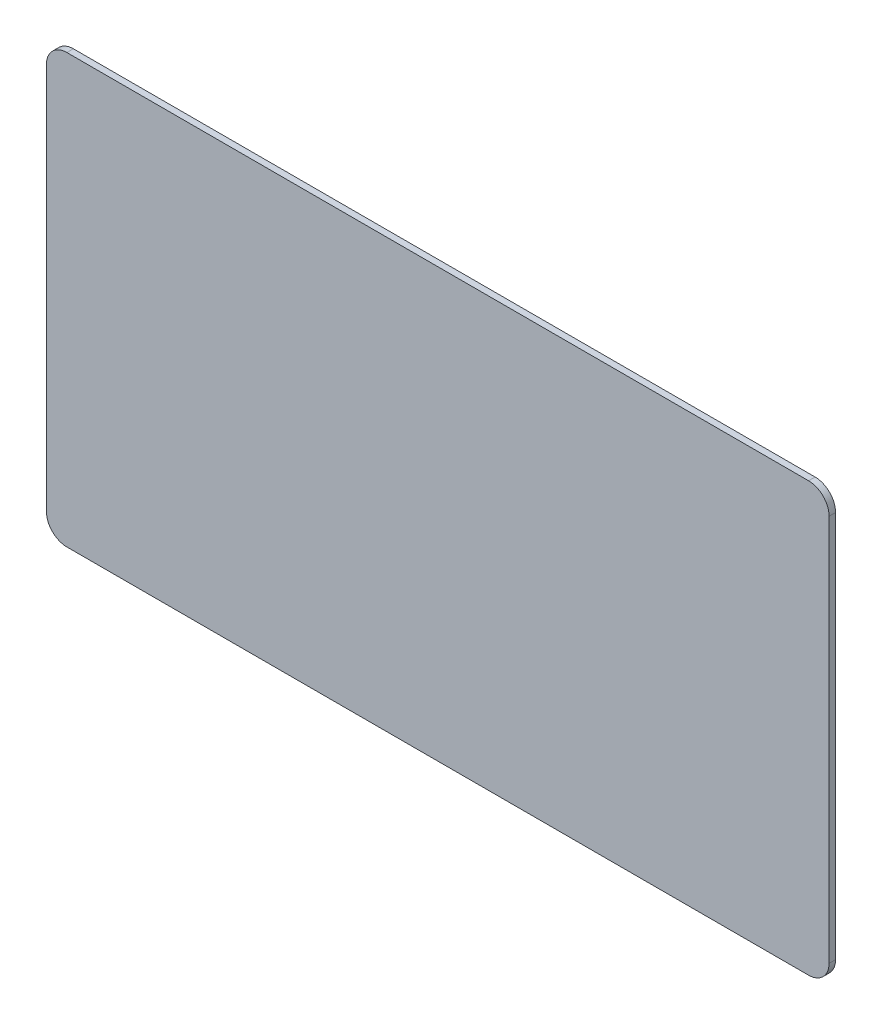
ISO-10303-21;
HEADER;
FILE_DESCRIPTION(('STEP AP214'),'2;1');
FILE_NAME('part.step','',(''),(''),'','','');
FILE_SCHEMA(('AUTOMOTIVE_DESIGN { 1 0 10303 214 1 1 1 1 }'));
ENDSEC;
DATA;
#1=APPLICATION_CONTEXT('core data for automotive mechanical design processes');
#2=APPLICATION_PROTOCOL_DEFINITION('international standard','automotive_design',2000,#1);
#3=PRODUCT_CONTEXT('',#1,'mechanical');
#4=PRODUCT('Part','Part','',(#3));
#5=PRODUCT_RELATED_PRODUCT_CATEGORY('part','',(#4));
#6=PRODUCT_DEFINITION_FORMATION('','',#4);
#7=PRODUCT_DEFINITION_CONTEXT('part definition',#1,'design');
#8=PRODUCT_DEFINITION('design','',#6,#7);
#9=PRODUCT_DEFINITION_SHAPE('','',#8);
#10=(LENGTH_UNIT() NAMED_UNIT(*) SI_UNIT(.MILLI.,.METRE.));
#11=(NAMED_UNIT(*) PLANE_ANGLE_UNIT() SI_UNIT($,.RADIAN.));
#12=(NAMED_UNIT(*) SI_UNIT($,.STERADIAN.) SOLID_ANGLE_UNIT());
#13=UNCERTAINTY_MEASURE_WITH_UNIT(LENGTH_MEASURE(1.E-05),#10,'distance_accuracy_value','');
#14=(GEOMETRIC_REPRESENTATION_CONTEXT(3) GLOBAL_UNCERTAINTY_ASSIGNED_CONTEXT((#13)) GLOBAL_UNIT_ASSIGNED_CONTEXT((#10,
#11,#12)) REPRESENTATION_CONTEXT('',''));
#15=CARTESIAN_POINT('',(0.,0.,0.));
#16=DIRECTION('',(0.,0.,1.));
#17=DIRECTION('',(1.,0.,0.));
#18=AXIS2_PLACEMENT_3D('',#15,#16,#17);
#19=CARTESIAN_POINT('',(372.,-10.,3.175));
#20=DIRECTION('',(0.,0.,-1.));
#21=DIRECTION('',(-1.,0.,0.));
#22=AXIS2_PLACEMENT_3D('',#19,#20,#21);
#23=CYLINDRICAL_SURFACE('',#22,10.);
#24=CARTESIAN_POINT('',(372.,-10.,0.));
#25=DIRECTION('',(0.,0.,1.));
#26=DIRECTION('',(-1.,0.,0.));
#27=AXIS2_PLACEMENT_3D('',#24,#25,#26);
#28=CIRCLE('',#27,10.);
#29=CARTESIAN_POINT('',(382.,-10.,0.));
#30=VERTEX_POINT('',#29);
#31=CARTESIAN_POINT('',(372.,0.,0.));
#32=VERTEX_POINT('',#31);
#33=EDGE_CURVE('E137',#30,#32,#28,.T.);
#34=ORIENTED_EDGE('',*,*,#33,.T.);
#35=DIRECTION('',(0.,0.,-1.));
#36=VECTOR('',#35,1.);
#37=CARTESIAN_POINT('',(372.,0.,3.175));
#38=LINE('',#37,#36);
#39=CARTESIAN_POINT('',(372.,0.,3.175));
#40=VERTEX_POINT('',#39);
#41=EDGE_CURVE('E11',#40,#32,#38,.T.);
#42=ORIENTED_EDGE('',*,*,#41,.F.);
#43=CARTESIAN_POINT('',(372.,-10.,3.175));
#44=DIRECTION('',(0.,0.,1.));
#45=DIRECTION('',(-1.,0.,0.));
#46=AXIS2_PLACEMENT_3D('',#43,#44,#45);
#47=CIRCLE('',#46,10.);
#48=CARTESIAN_POINT('',(382.,-10.,3.175));
#49=VERTEX_POINT('',#48);
#50=EDGE_CURVE('E151',#49,#40,#47,.T.);
#51=ORIENTED_EDGE('',*,*,#50,.F.);
#52=DIRECTION('',(0.,0.,-1.));
#53=VECTOR('',#52,1.);
#54=CARTESIAN_POINT('',(382.,-10.,3.175));
#55=LINE('',#54,#53);
#56=EDGE_CURVE('E133',#49,#30,#55,.T.);
#57=ORIENTED_EDGE('',*,*,#56,.T.);
#58=EDGE_LOOP('',(#34,#42,#51,#57));
#59=FACE_BOUND('',#58,.T.);
#60=ADVANCED_FACE('F41',(#59),#23,.T.);
#61=CARTESIAN_POINT('',(10.0000000000001,0.,3.175));
#62=DIRECTION('',(0.,-1.,0.));
#63=DIRECTION('',(0.,0.,-1.));
#64=AXIS2_PLACEMENT_3D('',#61,#62,#63);
#65=PLANE('',#64);
#66=DIRECTION('',(-1.,0.,0.));
#67=VECTOR('',#66,1.);
#68=CARTESIAN_POINT('',(10.0000000000001,0.,0.));
#69=LINE('',#68,#67);
#70=CARTESIAN_POINT('',(10.0000000000001,0.,0.));
#71=VERTEX_POINT('',#70);
#72=EDGE_CURVE('E140',#32,#71,#69,.T.);
#73=ORIENTED_EDGE('',*,*,#72,.T.);
#74=DIRECTION('',(0.,0.,-1.));
#75=VECTOR('',#74,1.);
#76=CARTESIAN_POINT('',(10.0000000000001,0.,3.175));
#77=LINE('',#76,#75);
#78=CARTESIAN_POINT('',(10.0000000000001,0.,3.175));
#79=VERTEX_POINT('',#78);
#80=EDGE_CURVE('E49',#79,#71,#77,.T.);
#81=ORIENTED_EDGE('',*,*,#80,.F.);
#82=DIRECTION('',(-1.,0.,0.));
#83=VECTOR('',#82,1.);
#84=CARTESIAN_POINT('',(10.0000000000001,0.,3.175));
#85=LINE('',#84,#83);
#86=EDGE_CURVE('E100',#40,#79,#85,.T.);
#87=ORIENTED_EDGE('',*,*,#86,.F.);
#88=ORIENTED_EDGE('',*,*,#41,.T.);
#89=EDGE_LOOP('',(#73,#81,#87,#88));
#90=FACE_BOUND('',#89,.T.);
#91=ADVANCED_FACE('F186',(#90),#65,.F.);
#92=CARTESIAN_POINT('',(10.,-10.,3.175));
#93=DIRECTION('',(0.,0.,-1.));
#94=DIRECTION('',(-1.,0.,0.));
#95=AXIS2_PLACEMENT_3D('',#92,#93,#94);
#96=CYLINDRICAL_SURFACE('',#95,10.);
#97=CARTESIAN_POINT('',(10.,-10.,0.));
#98=DIRECTION('',(0.,0.,1.));
#99=DIRECTION('',(1.,0.,0.));
#100=AXIS2_PLACEMENT_3D('',#97,#98,#99);
#101=CIRCLE('',#100,10.);
#102=CARTESIAN_POINT('',(0.,-10.0000000000001,0.));
#103=VERTEX_POINT('',#102);
#104=EDGE_CURVE('E142',#71,#103,#101,.T.);
#105=ORIENTED_EDGE('',*,*,#104,.T.);
#106=DIRECTION('',(0.,0.,-1.));
#107=VECTOR('',#106,1.);
#108=CARTESIAN_POINT('',(0.,-10.0000000000001,3.175));
#109=LINE('',#108,#107);
#110=CARTESIAN_POINT('',(0.,-10.0000000000001,3.175));
#111=VERTEX_POINT('',#110);
#112=EDGE_CURVE('E158',#111,#103,#109,.T.);
#113=ORIENTED_EDGE('',*,*,#112,.F.);
#114=CARTESIAN_POINT('',(10.,-10.,3.175));
#115=DIRECTION('',(0.,0.,1.));
#116=DIRECTION('',(1.,0.,0.));
#117=AXIS2_PLACEMENT_3D('',#114,#115,#116);
#118=CIRCLE('',#117,10.);
#119=EDGE_CURVE('E166',#79,#111,#118,.T.);
#120=ORIENTED_EDGE('',*,*,#119,.F.);
#121=ORIENTED_EDGE('',*,*,#80,.T.);
#122=EDGE_LOOP('',(#105,#113,#120,#121));
#123=FACE_BOUND('',#122,.T.);
#124=ADVANCED_FACE('F164',(#123),#96,.T.);
#125=CARTESIAN_POINT('',(0.,-10.0000000000001,3.175));
#126=DIRECTION('',(1.,0.,0.));
#127=DIRECTION('',(0.,1.,0.));
#128=AXIS2_PLACEMENT_3D('',#125,#126,#127);
#129=PLANE('',#128);
#130=DIRECTION('',(0.,-1.,0.));
#131=VECTOR('',#130,1.);
#132=CARTESIAN_POINT('',(0.,-10.0000000000001,0.));
#133=LINE('',#132,#131);
#134=CARTESIAN_POINT('',(0.,-199.,0.));
#135=VERTEX_POINT('',#134);
#136=EDGE_CURVE('E144',#103,#135,#133,.T.);
#137=ORIENTED_EDGE('',*,*,#136,.T.);
#138=DIRECTION('',(0.,0.,-1.));
#139=VECTOR('',#138,1.);
#140=CARTESIAN_POINT('',(0.,-199.,3.175));
#141=LINE('',#140,#139);
#142=CARTESIAN_POINT('',(0.,-199.,3.175));
#143=VERTEX_POINT('',#142);
#144=EDGE_CURVE('E155',#143,#135,#141,.T.);
#145=ORIENTED_EDGE('',*,*,#144,.F.);
#146=DIRECTION('',(0.,-1.,0.));
#147=VECTOR('',#146,1.);
#148=CARTESIAN_POINT('',(0.,-10.0000000000001,3.175));
#149=LINE('',#148,#147);
#150=EDGE_CURVE('E178',#111,#143,#149,.T.);
#151=ORIENTED_EDGE('',*,*,#150,.F.);
#152=ORIENTED_EDGE('',*,*,#112,.T.);
#153=EDGE_LOOP('',(#137,#145,#151,#152));
#154=FACE_BOUND('',#153,.T.);
#155=ADVANCED_FACE('F174',(#154),#129,.F.);
#156=CARTESIAN_POINT('',(10.,-199.,3.175));
#157=DIRECTION('',(0.,0.,-1.));
#158=DIRECTION('',(-1.,0.,0.));
#159=AXIS2_PLACEMENT_3D('',#156,#157,#158);
#160=CYLINDRICAL_SURFACE('',#159,10.);
#161=CARTESIAN_POINT('',(10.,-199.,0.));
#162=DIRECTION('',(0.,0.,1.));
#163=DIRECTION('',(1.,0.,0.));
#164=AXIS2_PLACEMENT_3D('',#161,#162,#163);
#165=CIRCLE('',#164,10.);
#166=CARTESIAN_POINT('',(10.,-209.,0.));
#167=VERTEX_POINT('',#166);
#168=EDGE_CURVE('E146',#135,#167,#165,.T.);
#169=ORIENTED_EDGE('',*,*,#168,.T.);
#170=DIRECTION('',(0.,0.,-1.));
#171=VECTOR('',#170,1.);
#172=CARTESIAN_POINT('',(10.,-209.,3.175));
#173=LINE('',#172,#171);
#174=CARTESIAN_POINT('',(10.,-209.,3.175));
#175=VERTEX_POINT('',#174);
#176=EDGE_CURVE('E128',#175,#167,#173,.T.);
#177=ORIENTED_EDGE('',*,*,#176,.F.);
#178=CARTESIAN_POINT('',(10.,-199.,3.175));
#179=DIRECTION('',(0.,0.,1.));
#180=DIRECTION('',(1.,0.,0.));
#181=AXIS2_PLACEMENT_3D('',#178,#179,#180);
#182=CIRCLE('',#181,10.);
#183=EDGE_CURVE('E119',#143,#175,#182,.T.);
#184=ORIENTED_EDGE('',*,*,#183,.F.);
#185=ORIENTED_EDGE('',*,*,#144,.T.);
#186=EDGE_LOOP('',(#169,#177,#184,#185));
#187=FACE_BOUND('',#186,.T.);
#188=ADVANCED_FACE('F177',(#187),#160,.T.);
#189=CARTESIAN_POINT('',(10.,-209.,3.175));
#190=DIRECTION('',(0.,1.,0.));
#191=DIRECTION('',(-1.,0.,0.));
#192=AXIS2_PLACEMENT_3D('',#189,#190,#191);
#193=PLANE('',#192);
#194=DIRECTION('',(1.,0.,0.));
#195=VECTOR('',#194,1.);
#196=CARTESIAN_POINT('',(10.,-209.,0.));
#197=LINE('',#196,#195);
#198=CARTESIAN_POINT('',(372.,-209.,0.));
#199=VERTEX_POINT('',#198);
#200=EDGE_CURVE('E127',#167,#199,#197,.T.);
#201=ORIENTED_EDGE('',*,*,#200,.T.);
#202=DIRECTION('',(0.,0.,-1.));
#203=VECTOR('',#202,1.);
#204=CARTESIAN_POINT('',(372.,-209.,3.175));
#205=LINE('',#204,#203);
#206=CARTESIAN_POINT('',(372.,-209.,3.175));
#207=VERTEX_POINT('',#206);
#208=EDGE_CURVE('E124',#207,#199,#205,.T.);
#209=ORIENTED_EDGE('',*,*,#208,.F.);
#210=DIRECTION('',(1.,0.,0.));
#211=VECTOR('',#210,1.);
#212=CARTESIAN_POINT('',(10.,-209.,3.175));
#213=LINE('',#212,#211);
#214=EDGE_CURVE('E113',#175,#207,#213,.T.);
#215=ORIENTED_EDGE('',*,*,#214,.F.);
#216=ORIENTED_EDGE('',*,*,#176,.T.);
#217=EDGE_LOOP('',(#201,#209,#215,#216));
#218=FACE_BOUND('',#217,.T.);
#219=ADVANCED_FACE('F125',(#218),#193,.F.);
#220=CARTESIAN_POINT('',(372.,-199.,3.175));
#221=DIRECTION('',(0.,0.,-1.));
#222=DIRECTION('',(-1.,0.,0.));
#223=AXIS2_PLACEMENT_3D('',#220,#221,#222);
#224=CYLINDRICAL_SURFACE('',#223,10.);
#225=CARTESIAN_POINT('',(372.,-199.,0.));
#226=DIRECTION('',(0.,0.,1.));
#227=DIRECTION('',(1.,0.,0.));
#228=AXIS2_PLACEMENT_3D('',#225,#226,#227);
#229=CIRCLE('',#228,10.);
#230=CARTESIAN_POINT('',(382.,-199.,0.));
#231=VERTEX_POINT('',#230);
#232=EDGE_CURVE('E86',#199,#231,#229,.T.);
#233=ORIENTED_EDGE('',*,*,#232,.T.);
#234=DIRECTION('',(0.,0.,-1.));
#235=VECTOR('',#234,1.);
#236=CARTESIAN_POINT('',(382.,-199.,3.175));
#237=LINE('',#236,#235);
#238=CARTESIAN_POINT('',(382.,-199.,3.175));
#239=VERTEX_POINT('',#238);
#240=EDGE_CURVE('E129',#239,#231,#237,.T.);
#241=ORIENTED_EDGE('',*,*,#240,.F.);
#242=CARTESIAN_POINT('',(372.,-199.,3.175));
#243=DIRECTION('',(0.,0.,1.));
#244=DIRECTION('',(1.,0.,0.));
#245=AXIS2_PLACEMENT_3D('',#242,#243,#244);
#246=CIRCLE('',#245,10.);
#247=EDGE_CURVE('E117',#207,#239,#246,.T.);
#248=ORIENTED_EDGE('',*,*,#247,.F.);
#249=ORIENTED_EDGE('',*,*,#208,.T.);
#250=EDGE_LOOP('',(#233,#241,#248,#249));
#251=FACE_BOUND('',#250,.T.);
#252=ADVANCED_FACE('F131',(#251),#224,.T.);
#253=CARTESIAN_POINT('',(382.,-10.,3.175));
#254=DIRECTION('',(-1.,0.,0.));
#255=DIRECTION('',(0.,0.,1.));
#256=AXIS2_PLACEMENT_3D('',#253,#254,#255);
#257=PLANE('',#256);
#258=DIRECTION('',(0.,1.,0.));
#259=VECTOR('',#258,1.);
#260=CARTESIAN_POINT('',(382.,-10.,0.));
#261=LINE('',#260,#259);
#262=EDGE_CURVE('E92',#231,#30,#261,.T.);
#263=ORIENTED_EDGE('',*,*,#262,.T.);
#264=ORIENTED_EDGE('',*,*,#56,.F.);
#265=DIRECTION('',(0.,1.,0.));
#266=VECTOR('',#265,1.);
#267=CARTESIAN_POINT('',(382.,-10.,3.175));
#268=LINE('',#267,#266);
#269=EDGE_CURVE('E57',#239,#49,#268,.T.);
#270=ORIENTED_EDGE('',*,*,#269,.F.);
#271=ORIENTED_EDGE('',*,*,#240,.T.);
#272=EDGE_LOOP('',(#263,#264,#270,#271));
#273=FACE_BOUND('',#272,.T.);
#274=ADVANCED_FACE('F202',(#273),#257,.F.);
#275=CARTESIAN_POINT('',(372.,-10.,3.175));
#276=DIRECTION('',(0.,0.,-1.));
#277=DIRECTION('',(-1.,0.,0.));
#278=AXIS2_PLACEMENT_3D('',#275,#276,#277);
#279=PLANE('',#278);
#280=ORIENTED_EDGE('',*,*,#50,.T.);
#281=ORIENTED_EDGE('',*,*,#86,.T.);
#282=ORIENTED_EDGE('',*,*,#119,.T.);
#283=ORIENTED_EDGE('',*,*,#150,.T.);
#284=ORIENTED_EDGE('',*,*,#183,.T.);
#285=ORIENTED_EDGE('',*,*,#214,.T.);
#286=ORIENTED_EDGE('',*,*,#247,.T.);
#287=ORIENTED_EDGE('',*,*,#269,.T.);
#288=EDGE_LOOP('',(#280,#281,#282,#283,#284,#285,#286,#287));
#289=FACE_BOUND('',#288,.T.);
#290=ADVANCED_FACE('F115',(#289),#279,.F.);
#291=CARTESIAN_POINT('',(372.,-10.,0.));
#292=DIRECTION('',(0.,0.,-1.));
#293=DIRECTION('',(-1.,0.,0.));
#294=AXIS2_PLACEMENT_3D('',#291,#292,#293);
#295=PLANE('',#294);
#296=ORIENTED_EDGE('',*,*,#33,.F.);
#297=ORIENTED_EDGE('',*,*,#262,.F.);
#298=ORIENTED_EDGE('',*,*,#232,.F.);
#299=ORIENTED_EDGE('',*,*,#200,.F.);
#300=ORIENTED_EDGE('',*,*,#168,.F.);
#301=ORIENTED_EDGE('',*,*,#136,.F.);
#302=ORIENTED_EDGE('',*,*,#104,.F.);
#303=ORIENTED_EDGE('',*,*,#72,.F.);
#304=EDGE_LOOP('',(#296,#297,#298,#299,#300,#301,#302,#303));
#305=FACE_BOUND('',#304,.T.);
#306=ADVANCED_FACE('F170',(#305),#295,.T.);
#307=CLOSED_SHELL('',(#60,#91,#124,#155,#188,#219,#252,#274,#290,#306));
#308=MANIFOLD_SOLID_BREP('B2',#307);
#309=ADVANCED_BREP_SHAPE_REPRESENTATION('',(#18,#308),#14);
#310=SHAPE_DEFINITION_REPRESENTATION(#9,#309);
ENDSEC;
END-ISO-10303-21;
